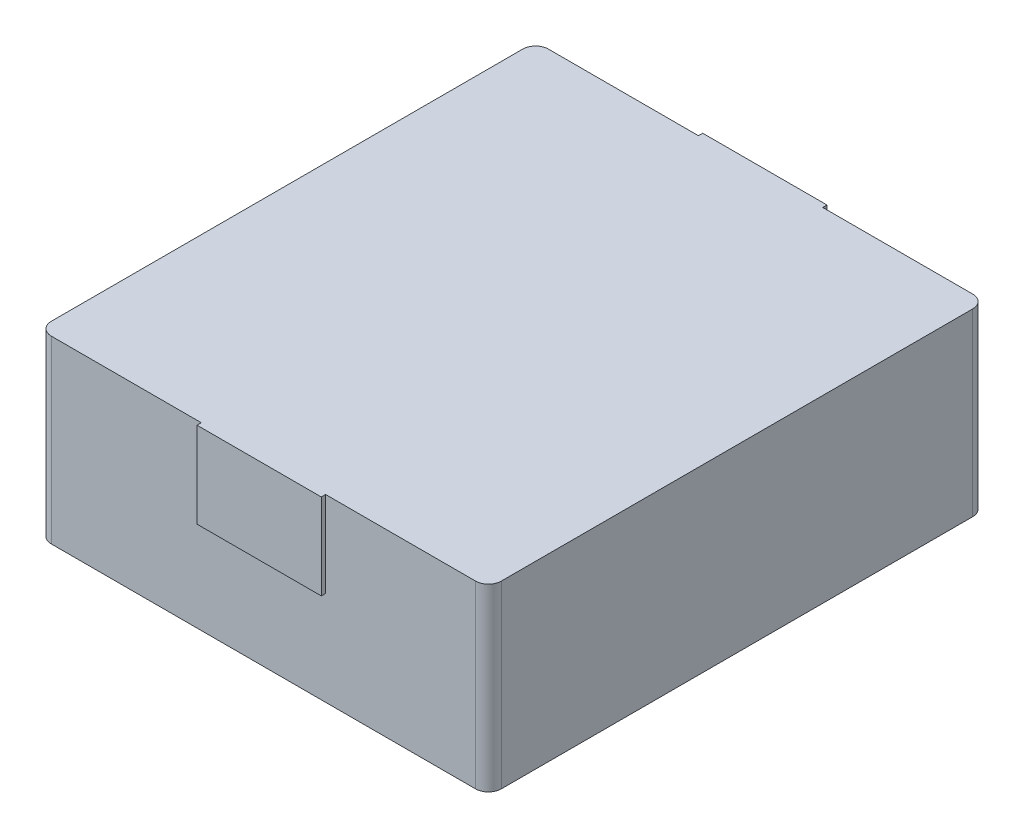
ISO-10303-21;
HEADER;
FILE_DESCRIPTION(('STEP AP214'),'2;1');
FILE_NAME('part.step','',(''),(''),'','','');
FILE_SCHEMA(('AUTOMOTIVE_DESIGN { 1 0 10303 214 1 1 1 1 }'));
ENDSEC;
DATA;
#1=APPLICATION_CONTEXT('core data for automotive mechanical design processes');
#2=APPLICATION_PROTOCOL_DEFINITION('international standard','automotive_design',2000,#1);
#3=PRODUCT_CONTEXT('',#1,'mechanical');
#4=PRODUCT('Part','Part','',(#3));
#5=PRODUCT_RELATED_PRODUCT_CATEGORY('part','',(#4));
#6=PRODUCT_DEFINITION_FORMATION('','',#4);
#7=PRODUCT_DEFINITION_CONTEXT('part definition',#1,'design');
#8=PRODUCT_DEFINITION('design','',#6,#7);
#9=PRODUCT_DEFINITION_SHAPE('','',#8);
#10=(LENGTH_UNIT() NAMED_UNIT(*) SI_UNIT(.MILLI.,.METRE.));
#11=(NAMED_UNIT(*) PLANE_ANGLE_UNIT() SI_UNIT($,.RADIAN.));
#12=(NAMED_UNIT(*) SI_UNIT($,.STERADIAN.) SOLID_ANGLE_UNIT());
#13=UNCERTAINTY_MEASURE_WITH_UNIT(LENGTH_MEASURE(1.E-05),#10,'distance_accuracy_value','');
#14=(GEOMETRIC_REPRESENTATION_CONTEXT(3) GLOBAL_UNCERTAINTY_ASSIGNED_CONTEXT((#13)) GLOBAL_UNIT_ASSIGNED_CONTEXT((#10,
#11,#12)) REPRESENTATION_CONTEXT('',''));
#15=CARTESIAN_POINT('',(0.,0.,0.));
#16=DIRECTION('',(0.,0.,1.));
#17=DIRECTION('',(1.,0.,0.));
#18=AXIS2_PLACEMENT_3D('',#15,#16,#17);
#19=CARTESIAN_POINT('',(24.35,5.75,-24.5));
#20=DIRECTION('',(0.,1.,0.));
#21=DIRECTION('',(0.,0.,-1.));
#22=AXIS2_PLACEMENT_3D('',#19,#20,#21);
#23=PLANE('',#22);
#24=DIRECTION('',(0.,0.,-1.));
#25=VECTOR('',#24,1.);
#26=CARTESIAN_POINT('',(21.45,5.75,-24.55));
#27=LINE('',#26,#25);
#28=CARTESIAN_POINT('',(21.45,5.75,-24.5));
#29=VERTEX_POINT('',#28);
#30=CARTESIAN_POINT('',(21.45,5.75,-24.6));
#31=VERTEX_POINT('',#30);
#32=EDGE_CURVE('E200',#29,#31,#27,.T.);
#33=ORIENTED_EDGE('',*,*,#32,.T.);
#34=DIRECTION('',(-1.,0.,0.));
#35=VECTOR('',#34,1.);
#36=CARTESIAN_POINT('',(22.9,5.75,-24.6));
#37=LINE('',#36,#35);
#38=CARTESIAN_POINT('',(24.35,5.75,-24.6));
#39=VERTEX_POINT('',#38);
#40=EDGE_CURVE('E152',#39,#31,#37,.T.);
#41=ORIENTED_EDGE('',*,*,#40,.F.);
#42=DIRECTION('',(0.,0.,1.));
#43=VECTOR('',#42,1.);
#44=CARTESIAN_POINT('',(24.35,5.75,-24.55));
#45=LINE('',#44,#43);
#46=CARTESIAN_POINT('',(24.35,5.75,-24.5));
#47=VERTEX_POINT('',#46);
#48=EDGE_CURVE('E199',#39,#47,#45,.T.);
#49=ORIENTED_EDGE('',*,*,#48,.T.);
#50=DIRECTION('',(-1.,0.,0.));
#51=VECTOR('',#50,1.);
#52=CARTESIAN_POINT('',(22.9,5.75,-24.5));
#53=LINE('',#52,#51);
#54=EDGE_CURVE('E240',#47,#29,#53,.T.);
#55=ORIENTED_EDGE('',*,*,#54,.T.);
#56=EDGE_LOOP('',(#33,#41,#49,#55));
#57=FACE_BOUND('',#56,.T.);
#58=ADVANCED_FACE('F17',(#57),#23,.F.);
#59=CARTESIAN_POINT('',(21.45,7.75,-24.6));
#60=DIRECTION('',(1.,0.,0.));
#61=DIRECTION('',(0.,0.,1.));
#62=AXIS2_PLACEMENT_3D('',#59,#60,#61);
#63=PLANE('',#62);
#64=ORIENTED_EDGE('',*,*,#32,.F.);
#65=DIRECTION('',(0.,1.,0.));
#66=VECTOR('',#65,1.);
#67=CARTESIAN_POINT('',(21.45,6.75,-24.5));
#68=LINE('',#67,#66);
#69=CARTESIAN_POINT('',(21.45,7.75,-24.5));
#70=VERTEX_POINT('',#69);
#71=EDGE_CURVE('E209',#29,#70,#68,.T.);
#72=ORIENTED_EDGE('',*,*,#71,.T.);
#73=DIRECTION('',(0.,0.,1.));
#74=VECTOR('',#73,1.);
#75=CARTESIAN_POINT('',(21.45,7.75,-24.55));
#76=LINE('',#75,#74);
#77=CARTESIAN_POINT('',(21.45,7.75,-24.6));
#78=VERTEX_POINT('',#77);
#79=EDGE_CURVE('E71',#78,#70,#76,.T.);
#80=ORIENTED_EDGE('',*,*,#79,.F.);
#81=DIRECTION('',(0.,1.,0.));
#82=VECTOR('',#81,1.);
#83=CARTESIAN_POINT('',(21.45,5.65,-24.6));
#84=LINE('',#83,#82);
#85=EDGE_CURVE('E150',#31,#78,#84,.T.);
#86=ORIENTED_EDGE('',*,*,#85,.F.);
#87=EDGE_LOOP('',(#64,#72,#80,#86));
#88=FACE_BOUND('',#87,.T.);
#89=ADVANCED_FACE('F327',(#88),#63,.F.);
#90=CARTESIAN_POINT('',(24.35,7.75,-24.5));
#91=DIRECTION('',(-1.,0.,0.));
#92=DIRECTION('',(0.,0.,-1.));
#93=AXIS2_PLACEMENT_3D('',#90,#91,#92);
#94=PLANE('',#93);
#95=ORIENTED_EDGE('',*,*,#48,.F.);
#96=DIRECTION('',(0.,-1.,0.));
#97=VECTOR('',#96,1.);
#98=CARTESIAN_POINT('',(24.35,5.65,-24.6));
#99=LINE('',#98,#97);
#100=CARTESIAN_POINT('',(24.35,7.75,-24.6));
#101=VERTEX_POINT('',#100);
#102=EDGE_CURVE('E146',#101,#39,#99,.T.);
#103=ORIENTED_EDGE('',*,*,#102,.F.);
#104=DIRECTION('',(0.,0.,-1.));
#105=VECTOR('',#104,1.);
#106=CARTESIAN_POINT('',(24.35,7.75,-24.55));
#107=LINE('',#106,#105);
#108=CARTESIAN_POINT('',(24.35,7.75,-24.5));
#109=VERTEX_POINT('',#108);
#110=EDGE_CURVE('E196',#109,#101,#107,.T.);
#111=ORIENTED_EDGE('',*,*,#110,.F.);
#112=DIRECTION('',(0.,-1.,0.));
#113=VECTOR('',#112,1.);
#114=CARTESIAN_POINT('',(24.35,6.75,-24.5));
#115=LINE('',#114,#113);
#116=EDGE_CURVE('E243',#109,#47,#115,.T.);
#117=ORIENTED_EDGE('',*,*,#116,.T.);
#118=EDGE_LOOP('',(#95,#103,#111,#117));
#119=FACE_BOUND('',#118,.T.);
#120=ADVANCED_FACE('F317',(#119),#94,.F.);
#121=CARTESIAN_POINT('',(17.95,3.55,-24.9));
#122=DIRECTION('',(0.,1.,0.));
#123=DIRECTION('',(0.,0.,1.));
#124=AXIS2_PLACEMENT_3D('',#121,#122,#123);
#125=CYLINDRICAL_SURFACE('',#124,0.300000000000002);
#126=CARTESIAN_POINT('',(17.95,3.55,-24.9));
#127=DIRECTION('',(0.,1.,0.));
#128=DIRECTION('',(0.,0.,1.));
#129=AXIS2_PLACEMENT_3D('',#126,#127,#128);
#130=CIRCLE('',#129,0.300000000000002);
#131=CARTESIAN_POINT('',(17.95,3.55,-24.6));
#132=VERTEX_POINT('',#131);
#133=CARTESIAN_POINT('',(17.65,3.55,-24.9));
#134=VERTEX_POINT('',#133);
#135=EDGE_CURVE('E248',#132,#134,#130,.F.);
#136=ORIENTED_EDGE('',*,*,#135,.F.);
#137=DIRECTION('',(0.,-1.,0.));
#138=VECTOR('',#137,1.);
#139=CARTESIAN_POINT('',(17.95,5.65,-24.6));
#140=LINE('',#139,#138);
#141=CARTESIAN_POINT('',(17.95,7.75,-24.6));
#142=VERTEX_POINT('',#141);
#143=EDGE_CURVE('E147',#142,#132,#140,.T.);
#144=ORIENTED_EDGE('',*,*,#143,.F.);
#145=CARTESIAN_POINT('',(17.95,7.75,-24.9));
#146=DIRECTION('',(0.,1.,0.));
#147=DIRECTION('',(0.,0.,1.));
#148=AXIS2_PLACEMENT_3D('',#145,#146,#147);
#149=CIRCLE('',#148,0.300000000000002);
#150=CARTESIAN_POINT('',(17.65,7.75,-24.9));
#151=VERTEX_POINT('',#150);
#152=EDGE_CURVE('E21',#151,#142,#149,.T.);
#153=ORIENTED_EDGE('',*,*,#152,.F.);
#154=DIRECTION('',(0.,1.,0.));
#155=VECTOR('',#154,1.);
#156=CARTESIAN_POINT('',(17.65,5.65,-24.9));
#157=LINE('',#156,#155);
#158=EDGE_CURVE('E141',#134,#151,#157,.T.);
#159=ORIENTED_EDGE('',*,*,#158,.F.);
#160=EDGE_LOOP('',(#136,#144,#153,#159));
#161=FACE_BOUND('',#160,.T.);
#162=ADVANCED_FACE('F314',(#161),#125,.T.);
#163=CARTESIAN_POINT('',(24.35,5.75,-36.3));
#164=DIRECTION('',(0.,-1.,0.));
#165=DIRECTION('',(0.,0.,1.));
#166=AXIS2_PLACEMENT_3D('',#163,#164,#165);
#167=PLANE('',#166);
#168=DIRECTION('',(-1.,0.,0.));
#169=VECTOR('',#168,1.);
#170=CARTESIAN_POINT('',(22.9,5.75,-36.3));
#171=LINE('',#170,#169);
#172=CARTESIAN_POINT('',(24.35,5.75,-36.3));
#173=VERTEX_POINT('',#172);
#174=CARTESIAN_POINT('',(21.45,5.75,-36.3));
#175=VERTEX_POINT('',#174);
#176=EDGE_CURVE('E221',#173,#175,#171,.T.);
#177=ORIENTED_EDGE('',*,*,#176,.F.);
#178=DIRECTION('',(0.,0.,-1.));
#179=VECTOR('',#178,1.);
#180=CARTESIAN_POINT('',(24.35,5.75,-36.25));
#181=LINE('',#180,#179);
#182=CARTESIAN_POINT('',(24.35,5.75,-36.2));
#183=VERTEX_POINT('',#182);
#184=EDGE_CURVE('E188',#183,#173,#181,.T.);
#185=ORIENTED_EDGE('',*,*,#184,.F.);
#186=DIRECTION('',(1.,0.,0.));
#187=VECTOR('',#186,1.);
#188=CARTESIAN_POINT('',(22.9,5.75,-36.2));
#189=LINE('',#188,#187);
#190=CARTESIAN_POINT('',(21.45,5.75,-36.2));
#191=VERTEX_POINT('',#190);
#192=EDGE_CURVE('E178',#191,#183,#189,.T.);
#193=ORIENTED_EDGE('',*,*,#192,.F.);
#194=DIRECTION('',(0.,0.,1.));
#195=VECTOR('',#194,1.);
#196=CARTESIAN_POINT('',(21.45,5.75,-36.25));
#197=LINE('',#196,#195);
#198=EDGE_CURVE('E170',#175,#191,#197,.T.);
#199=ORIENTED_EDGE('',*,*,#198,.F.);
#200=EDGE_LOOP('',(#177,#185,#193,#199));
#201=FACE_BOUND('',#200,.T.);
#202=ADVANCED_FACE('F316',(#201),#167,.T.);
#203=CARTESIAN_POINT('',(24.35,7.75,-36.3));
#204=DIRECTION('',(1.,0.,0.));
#205=DIRECTION('',(0.,0.,1.));
#206=AXIS2_PLACEMENT_3D('',#203,#204,#205);
#207=PLANE('',#206);
#208=DIRECTION('',(0.,-1.,0.));
#209=VECTOR('',#208,1.);
#210=CARTESIAN_POINT('',(24.35,6.75,-36.3));
#211=LINE('',#210,#209);
#212=CARTESIAN_POINT('',(24.35,7.75,-36.3));
#213=VERTEX_POINT('',#212);
#214=EDGE_CURVE('E143',#213,#173,#211,.T.);
#215=ORIENTED_EDGE('',*,*,#214,.F.);
#216=DIRECTION('',(0.,0.,1.));
#217=VECTOR('',#216,1.);
#218=CARTESIAN_POINT('',(24.35,7.75,-36.25));
#219=LINE('',#218,#217);
#220=CARTESIAN_POINT('',(24.35,7.75,-36.2));
#221=VERTEX_POINT('',#220);
#222=EDGE_CURVE('E185',#213,#221,#219,.T.);
#223=ORIENTED_EDGE('',*,*,#222,.T.);
#224=DIRECTION('',(0.,1.,0.));
#225=VECTOR('',#224,1.);
#226=CARTESIAN_POINT('',(24.35,5.65,-36.2));
#227=LINE('',#226,#225);
#228=EDGE_CURVE('E181',#183,#221,#227,.T.);
#229=ORIENTED_EDGE('',*,*,#228,.F.);
#230=ORIENTED_EDGE('',*,*,#184,.T.);
#231=EDGE_LOOP('',(#215,#223,#229,#230));
#232=FACE_BOUND('',#231,.T.);
#233=ADVANCED_FACE('F324',(#232),#207,.T.);
#234=CARTESIAN_POINT('',(17.95,3.55,-35.9));
#235=DIRECTION('',(0.,1.,0.));
#236=DIRECTION('',(-1.,0.,0.));
#237=AXIS2_PLACEMENT_3D('',#234,#235,#236);
#238=CYLINDRICAL_SURFACE('',#237,0.300000000000002);
#239=CARTESIAN_POINT('',(17.95,3.55,-35.9));
#240=DIRECTION('',(0.,1.,0.));
#241=DIRECTION('',(-1.,0.,0.));
#242=AXIS2_PLACEMENT_3D('',#239,#240,#241);
#243=CIRCLE('',#242,0.300000000000002);
#244=CARTESIAN_POINT('',(17.65,3.55,-35.9));
#245=VERTEX_POINT('',#244);
#246=CARTESIAN_POINT('',(17.95,3.55,-36.2));
#247=VERTEX_POINT('',#246);
#248=EDGE_CURVE('E106',#245,#247,#243,.F.);
#249=ORIENTED_EDGE('',*,*,#248,.F.);
#250=DIRECTION('',(0.,-1.,0.));
#251=VECTOR('',#250,1.);
#252=CARTESIAN_POINT('',(17.65,5.65,-35.9));
#253=LINE('',#252,#251);
#254=CARTESIAN_POINT('',(17.65,7.75,-35.9));
#255=VERTEX_POINT('',#254);
#256=EDGE_CURVE('E144',#255,#245,#253,.T.);
#257=ORIENTED_EDGE('',*,*,#256,.F.);
#258=CARTESIAN_POINT('',(17.95,7.75,-35.9));
#259=DIRECTION('',(0.,1.,0.));
#260=DIRECTION('',(-1.,0.,0.));
#261=AXIS2_PLACEMENT_3D('',#258,#259,#260);
#262=CIRCLE('',#261,0.300000000000002);
#263=CARTESIAN_POINT('',(17.95,7.75,-36.2));
#264=VERTEX_POINT('',#263);
#265=EDGE_CURVE('E129',#264,#255,#262,.T.);
#266=ORIENTED_EDGE('',*,*,#265,.F.);
#267=DIRECTION('',(0.,1.,0.));
#268=VECTOR('',#267,1.);
#269=CARTESIAN_POINT('',(17.95,5.65,-36.2));
#270=LINE('',#269,#268);
#271=EDGE_CURVE('E121',#247,#264,#270,.T.);
#272=ORIENTED_EDGE('',*,*,#271,.F.);
#273=EDGE_LOOP('',(#249,#257,#266,#272));
#274=FACE_BOUND('',#273,.T.);
#275=ADVANCED_FACE('F128',(#274),#238,.T.);
#276=CARTESIAN_POINT('',(21.45,7.75,-36.2));
#277=DIRECTION('',(-1.,0.,0.));
#278=DIRECTION('',(0.,0.,-1.));
#279=AXIS2_PLACEMENT_3D('',#276,#277,#278);
#280=PLANE('',#279);
#281=DIRECTION('',(0.,1.,0.));
#282=VECTOR('',#281,1.);
#283=CARTESIAN_POINT('',(21.45,6.75,-36.3));
#284=LINE('',#283,#282);
#285=CARTESIAN_POINT('',(21.45,7.75,-36.3));
#286=VERTEX_POINT('',#285);
#287=EDGE_CURVE('E182',#175,#286,#284,.T.);
#288=ORIENTED_EDGE('',*,*,#287,.F.);
#289=ORIENTED_EDGE('',*,*,#198,.T.);
#290=DIRECTION('',(0.,-1.,0.));
#291=VECTOR('',#290,1.);
#292=CARTESIAN_POINT('',(21.45,5.65,-36.2));
#293=LINE('',#292,#291);
#294=CARTESIAN_POINT('',(21.45,7.75,-36.2));
#295=VERTEX_POINT('',#294);
#296=EDGE_CURVE('E130',#295,#191,#293,.T.);
#297=ORIENTED_EDGE('',*,*,#296,.F.);
#298=DIRECTION('',(0.,0.,-1.));
#299=VECTOR('',#298,1.);
#300=CARTESIAN_POINT('',(21.45,7.75,-36.25));
#301=LINE('',#300,#299);
#302=EDGE_CURVE('E167',#295,#286,#301,.T.);
#303=ORIENTED_EDGE('',*,*,#302,.T.);
#304=EDGE_LOOP('',(#288,#289,#297,#303));
#305=FACE_BOUND('',#304,.T.);
#306=ADVANCED_FACE('F355',(#305),#280,.T.);
#307=CARTESIAN_POINT('',(27.85,3.55,-35.9));
#308=DIRECTION('',(0.,1.,0.));
#309=DIRECTION('',(0.,0.,1.));
#310=AXIS2_PLACEMENT_3D('',#307,#308,#309);
#311=CYLINDRICAL_SURFACE('',#310,0.299999999999991);
#312=CARTESIAN_POINT('',(27.85,3.55,-35.9));
#313=DIRECTION('',(0.,1.,0.));
#314=DIRECTION('',(0.,0.,1.));
#315=AXIS2_PLACEMENT_3D('',#312,#313,#314);
#316=CIRCLE('',#315,0.299999999999991);
#317=CARTESIAN_POINT('',(27.85,3.55,-36.2));
#318=VERTEX_POINT('',#317);
#319=CARTESIAN_POINT('',(28.15,3.55,-35.9));
#320=VERTEX_POINT('',#319);
#321=EDGE_CURVE('E115',#318,#320,#316,.F.);
#322=ORIENTED_EDGE('',*,*,#321,.F.);
#323=DIRECTION('',(0.,-1.,0.));
#324=VECTOR('',#323,1.);
#325=CARTESIAN_POINT('',(27.85,5.65,-36.2));
#326=LINE('',#325,#324);
#327=CARTESIAN_POINT('',(27.85,7.75,-36.2));
#328=VERTEX_POINT('',#327);
#329=EDGE_CURVE('E125',#328,#318,#326,.T.);
#330=ORIENTED_EDGE('',*,*,#329,.F.);
#331=CARTESIAN_POINT('',(27.85,7.75,-35.9));
#332=DIRECTION('',(0.,1.,0.));
#333=DIRECTION('',(0.,0.,1.));
#334=AXIS2_PLACEMENT_3D('',#331,#332,#333);
#335=CIRCLE('',#334,0.299999999999991);
#336=CARTESIAN_POINT('',(28.15,7.75,-35.9));
#337=VERTEX_POINT('',#336);
#338=EDGE_CURVE('E175',#337,#328,#335,.T.);
#339=ORIENTED_EDGE('',*,*,#338,.F.);
#340=DIRECTION('',(0.,1.,0.));
#341=VECTOR('',#340,1.);
#342=CARTESIAN_POINT('',(28.15,5.65,-35.9));
#343=LINE('',#342,#341);
#344=EDGE_CURVE('E133',#320,#337,#343,.T.);
#345=ORIENTED_EDGE('',*,*,#344,.F.);
#346=EDGE_LOOP('',(#322,#330,#339,#345));
#347=FACE_BOUND('',#346,.T.);
#348=ADVANCED_FACE('F302',(#347),#311,.T.);
#349=CARTESIAN_POINT('',(27.85,3.55,-24.9));
#350=DIRECTION('',(0.,1.,0.));
#351=DIRECTION('',(-1.,0.,0.));
#352=AXIS2_PLACEMENT_3D('',#349,#350,#351);
#353=CYLINDRICAL_SURFACE('',#352,0.299999999999998);
#354=CARTESIAN_POINT('',(27.85,3.55,-24.9));
#355=DIRECTION('',(0.,1.,0.));
#356=DIRECTION('',(-1.,0.,0.));
#357=AXIS2_PLACEMENT_3D('',#354,#355,#356);
#358=CIRCLE('',#357,0.299999999999998);
#359=CARTESIAN_POINT('',(28.15,3.55,-24.9));
#360=VERTEX_POINT('',#359);
#361=CARTESIAN_POINT('',(27.85,3.55,-24.6));
#362=VERTEX_POINT('',#361);
#363=EDGE_CURVE('E261',#360,#362,#358,.F.);
#364=ORIENTED_EDGE('',*,*,#363,.F.);
#365=DIRECTION('',(0.,-1.,0.));
#366=VECTOR('',#365,1.);
#367=CARTESIAN_POINT('',(28.15,5.65,-24.9));
#368=LINE('',#367,#366);
#369=CARTESIAN_POINT('',(28.15,7.75,-24.9));
#370=VERTEX_POINT('',#369);
#371=EDGE_CURVE('E166',#370,#360,#368,.T.);
#372=ORIENTED_EDGE('',*,*,#371,.F.);
#373=CARTESIAN_POINT('',(27.85,7.75,-24.9));
#374=DIRECTION('',(0.,1.,0.));
#375=DIRECTION('',(-1.,0.,0.));
#376=AXIS2_PLACEMENT_3D('',#373,#374,#375);
#377=CIRCLE('',#376,0.299999999999998);
#378=CARTESIAN_POINT('',(27.85,7.75,-24.6));
#379=VERTEX_POINT('',#378);
#380=EDGE_CURVE('E36',#379,#370,#377,.T.);
#381=ORIENTED_EDGE('',*,*,#380,.F.);
#382=DIRECTION('',(0.,1.,0.));
#383=VECTOR('',#382,1.);
#384=CARTESIAN_POINT('',(27.85,5.65,-24.6));
#385=LINE('',#384,#383);
#386=EDGE_CURVE('E155',#362,#379,#385,.T.);
#387=ORIENTED_EDGE('',*,*,#386,.F.);
#388=EDGE_LOOP('',(#364,#372,#381,#387));
#389=FACE_BOUND('',#388,.T.);
#390=ADVANCED_FACE('F309',(#389),#353,.T.);
#391=CARTESIAN_POINT('',(28.25605,3.55,-36.316));
#392=DIRECTION('',(0.,-1.,0.));
#393=DIRECTION('',(0.,0.,1.));
#394=AXIS2_PLACEMENT_3D('',#391,#392,#393);
#395=PLANE('',#394);
#396=ORIENTED_EDGE('',*,*,#135,.T.);
#397=DIRECTION('',(0.,0.,1.));
#398=VECTOR('',#397,1.);
#399=CARTESIAN_POINT('',(17.65,3.55,-30.4));
#400=LINE('',#399,#398);
#401=EDGE_CURVE('E111',#245,#134,#400,.T.);
#402=ORIENTED_EDGE('',*,*,#401,.F.);
#403=ORIENTED_EDGE('',*,*,#248,.T.);
#404=DIRECTION('',(-1.,0.,0.));
#405=VECTOR('',#404,1.);
#406=CARTESIAN_POINT('',(22.9,3.55,-36.2));
#407=LINE('',#406,#405);
#408=EDGE_CURVE('E109',#318,#247,#407,.T.);
#409=ORIENTED_EDGE('',*,*,#408,.F.);
#410=ORIENTED_EDGE('',*,*,#321,.T.);
#411=DIRECTION('',(0.,0.,-1.));
#412=VECTOR('',#411,1.);
#413=CARTESIAN_POINT('',(28.15,3.55,-30.4));
#414=LINE('',#413,#412);
#415=EDGE_CURVE('E162',#360,#320,#414,.T.);
#416=ORIENTED_EDGE('',*,*,#415,.F.);
#417=ORIENTED_EDGE('',*,*,#363,.T.);
#418=DIRECTION('',(1.,0.,0.));
#419=VECTOR('',#418,1.);
#420=CARTESIAN_POINT('',(22.9,3.55,-24.6));
#421=LINE('',#420,#419);
#422=EDGE_CURVE('E149',#132,#362,#421,.T.);
#423=ORIENTED_EDGE('',*,*,#422,.F.);
#424=EDGE_LOOP('',(#396,#402,#403,#409,#410,#416,#417,#423));
#425=FACE_BOUND('',#424,.T.);
#426=ADVANCED_FACE('F108',(#425),#395,.T.);
#427=CARTESIAN_POINT('',(21.45,7.75,-24.5));
#428=DIRECTION('',(0.,0.,-1.));
#429=DIRECTION('',(1.,0.,0.));
#430=AXIS2_PLACEMENT_3D('',#427,#428,#429);
#431=PLANE('',#430);
#432=ORIENTED_EDGE('',*,*,#54,.F.);
#433=ORIENTED_EDGE('',*,*,#116,.F.);
#434=DIRECTION('',(-1.,0.,0.));
#435=VECTOR('',#434,1.);
#436=CARTESIAN_POINT('',(22.900525,7.75,-24.5));
#437=LINE('',#436,#435);
#438=EDGE_CURVE('E251',#109,#70,#437,.T.);
#439=ORIENTED_EDGE('',*,*,#438,.T.);
#440=ORIENTED_EDGE('',*,*,#71,.F.);
#441=EDGE_LOOP('',(#432,#433,#439,#440));
#442=FACE_BOUND('',#441,.T.);
#443=ADVANCED_FACE('F349',(#442),#431,.F.);
#444=CARTESIAN_POINT('',(27.85,7.75,-24.6));
#445=DIRECTION('',(0.,0.,1.));
#446=DIRECTION('',(-1.,0.,0.));
#447=AXIS2_PLACEMENT_3D('',#444,#445,#446);
#448=PLANE('',#447);
#449=DIRECTION('',(-1.,0.,0.));
#450=VECTOR('',#449,1.);
#451=CARTESIAN_POINT('',(22.900525,7.75,-24.6));
#452=LINE('',#451,#450);
#453=EDGE_CURVE('E165',#379,#101,#452,.T.);
#454=ORIENTED_EDGE('',*,*,#453,.T.);
#455=ORIENTED_EDGE('',*,*,#102,.T.);
#456=ORIENTED_EDGE('',*,*,#40,.T.);
#457=ORIENTED_EDGE('',*,*,#85,.T.);
#458=DIRECTION('',(-1.,0.,0.));
#459=VECTOR('',#458,1.);
#460=CARTESIAN_POINT('',(22.900525,7.75,-24.6));
#461=LINE('',#460,#459);
#462=EDGE_CURVE('E254',#78,#142,#461,.T.);
#463=ORIENTED_EDGE('',*,*,#462,.T.);
#464=ORIENTED_EDGE('',*,*,#143,.T.);
#465=ORIENTED_EDGE('',*,*,#422,.T.);
#466=ORIENTED_EDGE('',*,*,#386,.T.);
#467=EDGE_LOOP('',(#454,#455,#456,#457,#463,#464,#465,#466));
#468=FACE_BOUND('',#467,.T.);
#469=ADVANCED_FACE('F312',(#468),#448,.T.);
#470=CARTESIAN_POINT('',(17.65,7.75,-24.9));
#471=DIRECTION('',(-1.,0.,0.));
#472=DIRECTION('',(0.,0.,-1.));
#473=AXIS2_PLACEMENT_3D('',#470,#471,#472);
#474=PLANE('',#473);
#475=ORIENTED_EDGE('',*,*,#158,.T.);
#476=DIRECTION('',(0.,0.,-1.));
#477=VECTOR('',#476,1.);
#478=CARTESIAN_POINT('',(17.65,7.75,-30.4));
#479=LINE('',#478,#477);
#480=EDGE_CURVE('E266',#151,#255,#479,.T.);
#481=ORIENTED_EDGE('',*,*,#480,.T.);
#482=ORIENTED_EDGE('',*,*,#256,.T.);
#483=ORIENTED_EDGE('',*,*,#401,.T.);
#484=EDGE_LOOP('',(#475,#481,#482,#483));
#485=FACE_BOUND('',#484,.T.);
#486=ADVANCED_FACE('F269',(#485),#474,.T.);
#487=CARTESIAN_POINT('',(21.45,7.75,-36.3));
#488=DIRECTION('',(0.,0.,-1.));
#489=DIRECTION('',(1.,0.,0.));
#490=AXIS2_PLACEMENT_3D('',#487,#488,#489);
#491=PLANE('',#490);
#492=ORIENTED_EDGE('',*,*,#176,.T.);
#493=ORIENTED_EDGE('',*,*,#287,.T.);
#494=DIRECTION('',(1.,0.,0.));
#495=VECTOR('',#494,1.);
#496=CARTESIAN_POINT('',(22.900525,7.75,-36.3));
#497=LINE('',#496,#495);
#498=EDGE_CURVE('E230',#286,#213,#497,.T.);
#499=ORIENTED_EDGE('',*,*,#498,.T.);
#500=ORIENTED_EDGE('',*,*,#214,.T.);
#501=EDGE_LOOP('',(#492,#493,#499,#500));
#502=FACE_BOUND('',#501,.T.);
#503=ADVANCED_FACE('F339',(#502),#491,.T.);
#504=CARTESIAN_POINT('',(17.95,7.75,-36.2));
#505=DIRECTION('',(0.,0.,-1.));
#506=DIRECTION('',(1.,0.,0.));
#507=AXIS2_PLACEMENT_3D('',#504,#505,#506);
#508=PLANE('',#507);
#509=DIRECTION('',(1.,0.,0.));
#510=VECTOR('',#509,1.);
#511=CARTESIAN_POINT('',(22.900525,7.75,-36.2));
#512=LINE('',#511,#510);
#513=EDGE_CURVE('E233',#264,#295,#512,.T.);
#514=ORIENTED_EDGE('',*,*,#513,.T.);
#515=ORIENTED_EDGE('',*,*,#296,.T.);
#516=ORIENTED_EDGE('',*,*,#192,.T.);
#517=ORIENTED_EDGE('',*,*,#228,.T.);
#518=DIRECTION('',(1.,0.,0.));
#519=VECTOR('',#518,1.);
#520=CARTESIAN_POINT('',(22.900525,7.75,-36.2));
#521=LINE('',#520,#519);
#522=EDGE_CURVE('E27',#221,#328,#521,.T.);
#523=ORIENTED_EDGE('',*,*,#522,.T.);
#524=ORIENTED_EDGE('',*,*,#329,.T.);
#525=ORIENTED_EDGE('',*,*,#408,.T.);
#526=ORIENTED_EDGE('',*,*,#271,.T.);
#527=EDGE_LOOP('',(#514,#515,#516,#517,#523,#524,#525,#526));
#528=FACE_BOUND('',#527,.T.);
#529=ADVANCED_FACE('F120',(#528),#508,.T.);
#530=CARTESIAN_POINT('',(28.15,7.75,-35.9));
#531=DIRECTION('',(1.,0.,0.));
#532=DIRECTION('',(0.,0.,1.));
#533=AXIS2_PLACEMENT_3D('',#530,#531,#532);
#534=PLANE('',#533);
#535=ORIENTED_EDGE('',*,*,#371,.T.);
#536=ORIENTED_EDGE('',*,*,#415,.T.);
#537=ORIENTED_EDGE('',*,*,#344,.T.);
#538=DIRECTION('',(0.,0.,1.));
#539=VECTOR('',#538,1.);
#540=CARTESIAN_POINT('',(28.15,7.75,-30.4));
#541=LINE('',#540,#539);
#542=EDGE_CURVE('E11',#337,#370,#541,.T.);
#543=ORIENTED_EDGE('',*,*,#542,.T.);
#544=EDGE_LOOP('',(#535,#536,#537,#543));
#545=FACE_BOUND('',#544,.T.);
#546=ADVANCED_FACE('F305',(#545),#534,.T.);
#547=CARTESIAN_POINT('',(28.25605,7.75,-36.3));
#548=DIRECTION('',(0.,-1.,0.));
#549=DIRECTION('',(0.,0.,1.));
#550=AXIS2_PLACEMENT_3D('',#547,#548,#549);
#551=PLANE('',#550);
#552=ORIENTED_EDGE('',*,*,#542,.F.);
#553=ORIENTED_EDGE('',*,*,#338,.T.);
#554=ORIENTED_EDGE('',*,*,#522,.F.);
#555=ORIENTED_EDGE('',*,*,#222,.F.);
#556=ORIENTED_EDGE('',*,*,#498,.F.);
#557=ORIENTED_EDGE('',*,*,#302,.F.);
#558=ORIENTED_EDGE('',*,*,#513,.F.);
#559=ORIENTED_EDGE('',*,*,#265,.T.);
#560=ORIENTED_EDGE('',*,*,#480,.F.);
#561=ORIENTED_EDGE('',*,*,#152,.T.);
#562=ORIENTED_EDGE('',*,*,#462,.F.);
#563=ORIENTED_EDGE('',*,*,#79,.T.);
#564=ORIENTED_EDGE('',*,*,#438,.F.);
#565=ORIENTED_EDGE('',*,*,#110,.T.);
#566=ORIENTED_EDGE('',*,*,#453,.F.);
#567=ORIENTED_EDGE('',*,*,#380,.T.);
#568=EDGE_LOOP('',(#552,#553,#554,#555,#556,#557,#558,#559,#560,#561,#562,#563,#564,#565,#566,#567));
#569=FACE_BOUND('',#568,.T.);
#570=ADVANCED_FACE('F19',(#569),#551,.F.);
#571=CLOSED_SHELL('',(#58,#89,#120,#162,#202,#233,#275,#306,#348,#390,#426,#443,#469,#486,#503,
#529,#546,#570));
#572=MANIFOLD_SOLID_BREP('B1',#571);
#573=ADVANCED_BREP_SHAPE_REPRESENTATION('',(#18,#572),#14);
#574=SHAPE_DEFINITION_REPRESENTATION(#9,#573);
ENDSEC;
END-ISO-10303-21;
